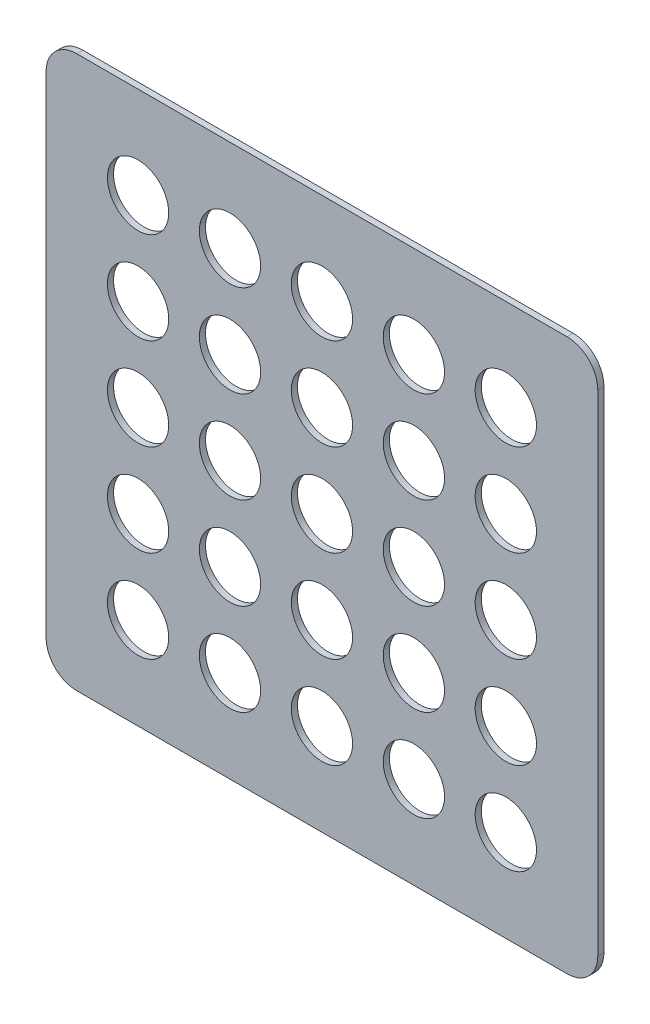
ISO-10303-21;
HEADER;
FILE_DESCRIPTION(('STEP AP214'),'2;1');
FILE_NAME('part.step','',(''),(''),'','','');
FILE_SCHEMA(('AUTOMOTIVE_DESIGN { 1 0 10303 214 1 1 1 1 }'));
ENDSEC;
DATA;
#1=APPLICATION_CONTEXT('core data for automotive mechanical design processes');
#2=APPLICATION_PROTOCOL_DEFINITION('international standard','automotive_design',2000,#1);
#3=PRODUCT_CONTEXT('',#1,'mechanical');
#4=PRODUCT('Part','Part','',(#3));
#5=PRODUCT_RELATED_PRODUCT_CATEGORY('part','',(#4));
#6=PRODUCT_DEFINITION_FORMATION('','',#4);
#7=PRODUCT_DEFINITION_CONTEXT('part definition',#1,'design');
#8=PRODUCT_DEFINITION('design','',#6,#7);
#9=PRODUCT_DEFINITION_SHAPE('','',#8);
#10=(LENGTH_UNIT() NAMED_UNIT(*) SI_UNIT(.MILLI.,.METRE.));
#11=(NAMED_UNIT(*) PLANE_ANGLE_UNIT() SI_UNIT($,.RADIAN.));
#12=(NAMED_UNIT(*) SI_UNIT($,.STERADIAN.) SOLID_ANGLE_UNIT());
#13=UNCERTAINTY_MEASURE_WITH_UNIT(LENGTH_MEASURE(1.E-05),#10,'distance_accuracy_value','');
#14=(GEOMETRIC_REPRESENTATION_CONTEXT(3) GLOBAL_UNCERTAINTY_ASSIGNED_CONTEXT((#13)) GLOBAL_UNIT_ASSIGNED_CONTEXT((#10,
#11,#12)) REPRESENTATION_CONTEXT('',''));
#15=CARTESIAN_POINT('',(0.,0.,0.));
#16=DIRECTION('',(0.,0.,1.));
#17=DIRECTION('',(1.,0.,0.));
#18=AXIS2_PLACEMENT_3D('',#15,#16,#17);
#19=CARTESIAN_POINT('',(2.25,-2.25,0.05));
#20=DIRECTION('',(-1.,0.,0.));
#21=DIRECTION('',(0.,0.,1.));
#22=AXIS2_PLACEMENT_3D('',#19,#20,#21);
#23=PLANE('',#22);
#24=DIRECTION('',(0.,1.,0.));
#25=VECTOR('',#24,1.);
#26=CARTESIAN_POINT('',(2.25,-2.25,0.05));
#27=LINE('',#26,#25);
#28=CARTESIAN_POINT('',(2.25,-2.,0.05));
#29=VERTEX_POINT('',#28);
#30=CARTESIAN_POINT('',(2.25,2.,0.05));
#31=VERTEX_POINT('',#30);
#32=EDGE_CURVE('E122',#29,#31,#27,.T.);
#33=ORIENTED_EDGE('',*,*,#32,.F.);
#34=DIRECTION('',(0.,0.,-1.));
#35=VECTOR('',#34,1.);
#36=CARTESIAN_POINT('',(2.25,-2.,0.05));
#37=LINE('',#36,#35);
#38=CARTESIAN_POINT('',(2.25,-2.,0.));
#39=VERTEX_POINT('',#38);
#40=EDGE_CURVE('E107',#29,#39,#37,.T.);
#41=ORIENTED_EDGE('',*,*,#40,.T.);
#42=DIRECTION('',(0.,1.,0.));
#43=VECTOR('',#42,1.);
#44=CARTESIAN_POINT('',(2.25,-2.25,0.));
#45=LINE('',#44,#43);
#46=CARTESIAN_POINT('',(2.25,2.,0.));
#47=VERTEX_POINT('',#46);
#48=EDGE_CURVE('E119',#39,#47,#45,.T.);
#49=ORIENTED_EDGE('',*,*,#48,.T.);
#50=DIRECTION('',(0.,0.,-1.));
#51=VECTOR('',#50,1.);
#52=CARTESIAN_POINT('',(2.25,2.,0.05));
#53=LINE('',#52,#51);
#54=EDGE_CURVE('E124',#47,#31,#53,.F.);
#55=ORIENTED_EDGE('',*,*,#54,.T.);
#56=EDGE_LOOP('',(#33,#41,#49,#55));
#57=FACE_BOUND('',#56,.T.);
#58=ADVANCED_FACE('F37',(#57),#23,.F.);
#59=CARTESIAN_POINT('',(-2.25,2.25,0.05));
#60=DIRECTION('',(0.,-1.,0.));
#61=DIRECTION('',(0.,0.,-1.));
#62=AXIS2_PLACEMENT_3D('',#59,#60,#61);
#63=PLANE('',#62);
#64=DIRECTION('',(-1.,0.,0.));
#65=VECTOR('',#64,1.);
#66=CARTESIAN_POINT('',(-2.25,2.25,0.));
#67=LINE('',#66,#65);
#68=CARTESIAN_POINT('',(2.,2.25,0.));
#69=VERTEX_POINT('',#68);
#70=CARTESIAN_POINT('',(-2.,2.25,0.));
#71=VERTEX_POINT('',#70);
#72=EDGE_CURVE('E128',#69,#71,#67,.T.);
#73=ORIENTED_EDGE('',*,*,#72,.T.);
#74=DIRECTION('',(0.,0.,-1.));
#75=VECTOR('',#74,1.);
#76=CARTESIAN_POINT('',(-2.,2.25,0.05));
#77=LINE('',#76,#75);
#78=CARTESIAN_POINT('',(-2.,2.25,0.05));
#79=VERTEX_POINT('',#78);
#80=EDGE_CURVE('E12',#71,#79,#77,.F.);
#81=ORIENTED_EDGE('',*,*,#80,.T.);
#82=DIRECTION('',(-1.,0.,0.));
#83=VECTOR('',#82,1.);
#84=CARTESIAN_POINT('',(-2.25,2.25,0.05));
#85=LINE('',#84,#83);
#86=CARTESIAN_POINT('',(2.,2.25,0.05));
#87=VERTEX_POINT('',#86);
#88=EDGE_CURVE('E168',#87,#79,#85,.T.);
#89=ORIENTED_EDGE('',*,*,#88,.F.);
#90=DIRECTION('',(0.,0.,-1.));
#91=VECTOR('',#90,1.);
#92=CARTESIAN_POINT('',(2.,2.25,0.05));
#93=LINE('',#92,#91);
#94=EDGE_CURVE('E45',#87,#69,#93,.T.);
#95=ORIENTED_EDGE('',*,*,#94,.T.);
#96=EDGE_LOOP('',(#73,#81,#89,#95));
#97=FACE_BOUND('',#96,.T.);
#98=ADVANCED_FACE('F166',(#97),#63,.F.);
#99=CARTESIAN_POINT('',(-2.25,-2.25,0.05));
#100=DIRECTION('',(1.,0.,0.));
#101=DIRECTION('',(0.,0.,-1.));
#102=AXIS2_PLACEMENT_3D('',#99,#100,#101);
#103=PLANE('',#102);
#104=DIRECTION('',(0.,-1.,0.));
#105=VECTOR('',#104,1.);
#106=CARTESIAN_POINT('',(-2.25,-2.25,0.));
#107=LINE('',#106,#105);
#108=CARTESIAN_POINT('',(-2.25,2.,0.));
#109=VERTEX_POINT('',#108);
#110=CARTESIAN_POINT('',(-2.25,-2.,0.));
#111=VERTEX_POINT('',#110);
#112=EDGE_CURVE('E132',#109,#111,#107,.T.);
#113=ORIENTED_EDGE('',*,*,#112,.T.);
#114=DIRECTION('',(0.,0.,-1.));
#115=VECTOR('',#114,1.);
#116=CARTESIAN_POINT('',(-2.25,-2.,0.05));
#117=LINE('',#116,#115);
#118=CARTESIAN_POINT('',(-2.25,-2.,0.05));
#119=VERTEX_POINT('',#118);
#120=EDGE_CURVE('E52',#111,#119,#117,.F.);
#121=ORIENTED_EDGE('',*,*,#120,.T.);
#122=DIRECTION('',(0.,-1.,0.));
#123=VECTOR('',#122,1.);
#124=CARTESIAN_POINT('',(-2.25,-2.25,0.05));
#125=LINE('',#124,#123);
#126=CARTESIAN_POINT('',(-2.25,2.,0.05));
#127=VERTEX_POINT('',#126);
#128=EDGE_CURVE('E176',#127,#119,#125,.T.);
#129=ORIENTED_EDGE('',*,*,#128,.F.);
#130=DIRECTION('',(0.,0.,-1.));
#131=VECTOR('',#130,1.);
#132=CARTESIAN_POINT('',(-2.25,2.,0.05));
#133=LINE('',#132,#131);
#134=EDGE_CURVE('E159',#127,#109,#133,.T.);
#135=ORIENTED_EDGE('',*,*,#134,.T.);
#136=EDGE_LOOP('',(#113,#121,#129,#135));
#137=FACE_BOUND('',#136,.T.);
#138=ADVANCED_FACE('F175',(#137),#103,.F.);
#139=CARTESIAN_POINT('',(-2.25,-2.25,0.05));
#140=DIRECTION('',(0.,1.,0.));
#141=DIRECTION('',(0.,0.,1.));
#142=AXIS2_PLACEMENT_3D('',#139,#140,#141);
#143=PLANE('',#142);
#144=DIRECTION('',(1.,0.,0.));
#145=VECTOR('',#144,1.);
#146=CARTESIAN_POINT('',(-2.25,-2.25,0.));
#147=LINE('',#146,#145);
#148=CARTESIAN_POINT('',(-2.,-2.25,0.));
#149=VERTEX_POINT('',#148);
#150=CARTESIAN_POINT('',(2.,-2.25,0.));
#151=VERTEX_POINT('',#150);
#152=EDGE_CURVE('E142',#149,#151,#147,.T.);
#153=ORIENTED_EDGE('',*,*,#152,.T.);
#154=DIRECTION('',(0.,0.,-1.));
#155=VECTOR('',#154,1.);
#156=CARTESIAN_POINT('',(2.,-2.25,0.05));
#157=LINE('',#156,#155);
#158=CARTESIAN_POINT('',(2.,-2.25,0.05));
#159=VERTEX_POINT('',#158);
#160=EDGE_CURVE('E108',#151,#159,#157,.F.);
#161=ORIENTED_EDGE('',*,*,#160,.T.);
#162=DIRECTION('',(1.,0.,0.));
#163=VECTOR('',#162,1.);
#164=CARTESIAN_POINT('',(-2.25,-2.25,0.05));
#165=LINE('',#164,#163);
#166=CARTESIAN_POINT('',(-2.,-2.25,0.05));
#167=VERTEX_POINT('',#166);
#168=EDGE_CURVE('E138',#167,#159,#165,.T.);
#169=ORIENTED_EDGE('',*,*,#168,.F.);
#170=DIRECTION('',(0.,0.,-1.));
#171=VECTOR('',#170,1.);
#172=CARTESIAN_POINT('',(-2.,-2.25,0.05));
#173=LINE('',#172,#171);
#174=EDGE_CURVE('E113',#167,#149,#173,.T.);
#175=ORIENTED_EDGE('',*,*,#174,.T.);
#176=EDGE_LOOP('',(#153,#161,#169,#175));
#177=FACE_BOUND('',#176,.T.);
#178=ADVANCED_FACE('F390',(#177),#143,.F.);
#179=CARTESIAN_POINT('',(0.,0.,0.05));
#180=DIRECTION('',(0.,0.,-1.));
#181=DIRECTION('',(-1.,0.,0.));
#182=AXIS2_PLACEMENT_3D('',#179,#180,#181);
#183=PLANE('',#182);
#184=CARTESIAN_POINT('',(1.49999999999999,-1.5,0.05));
#185=DIRECTION('',(0.,0.,1.));
#186=DIRECTION('',(1.,0.,0.));
#187=AXIS2_PLACEMENT_3D('',#184,#185,#186);
#188=CIRCLE('',#187,0.25);
#189=CARTESIAN_POINT('',(1.74999999999999,-1.5,0.05));
#190=VERTEX_POINT('',#189);
#191=EDGE_CURVE('E262',#190,#190,#188,.T.);
#192=ORIENTED_EDGE('',*,*,#191,.F.);
#193=EDGE_LOOP('',(#192));
#194=FACE_BOUND('',#193,.T.);
#195=CARTESIAN_POINT('',(1.5,-0.75,0.05));
#196=DIRECTION('',(0.,0.,1.));
#197=DIRECTION('',(1.,0.,0.));
#198=AXIS2_PLACEMENT_3D('',#195,#196,#197);
#199=CIRCLE('',#198,0.25);
#200=CARTESIAN_POINT('',(1.75,-0.75,0.05));
#201=VERTEX_POINT('',#200);
#202=EDGE_CURVE('E274',#201,#201,#199,.T.);
#203=ORIENTED_EDGE('',*,*,#202,.F.);
#204=EDGE_LOOP('',(#203));
#205=FACE_BOUND('',#204,.T.);
#206=CARTESIAN_POINT('',(1.5,0.,0.05));
#207=DIRECTION('',(0.,0.,1.));
#208=DIRECTION('',(1.,0.,0.));
#209=AXIS2_PLACEMENT_3D('',#206,#207,#208);
#210=CIRCLE('',#209,0.25);
#211=CARTESIAN_POINT('',(1.75,0.,0.05));
#212=VERTEX_POINT('',#211);
#213=EDGE_CURVE('E280',#212,#212,#210,.T.);
#214=ORIENTED_EDGE('',*,*,#213,.F.);
#215=EDGE_LOOP('',(#214));
#216=FACE_BOUND('',#215,.T.);
#217=CARTESIAN_POINT('',(0.75,0.,0.05));
#218=DIRECTION('',(0.,0.,1.));
#219=DIRECTION('',(1.,0.,0.));
#220=AXIS2_PLACEMENT_3D('',#217,#218,#219);
#221=CIRCLE('',#220,0.25);
#222=CARTESIAN_POINT('',(1.,0.,0.05));
#223=VERTEX_POINT('',#222);
#224=EDGE_CURVE('E287',#223,#223,#221,.T.);
#225=ORIENTED_EDGE('',*,*,#224,.F.);
#226=EDGE_LOOP('',(#225));
#227=FACE_BOUND('',#226,.T.);
#228=CARTESIAN_POINT('',(0.,0.,0.05));
#229=DIRECTION('',(0.,0.,1.));
#230=DIRECTION('',(1.,0.,0.));
#231=AXIS2_PLACEMENT_3D('',#228,#229,#230);
#232=CIRCLE('',#231,0.25);
#233=CARTESIAN_POINT('',(0.25,0.,0.05));
#234=VERTEX_POINT('',#233);
#235=EDGE_CURVE('E296',#234,#234,#232,.T.);
#236=ORIENTED_EDGE('',*,*,#235,.F.);
#237=EDGE_LOOP('',(#236));
#238=FACE_BOUND('',#237,.T.);
#239=CARTESIAN_POINT('',(-0.75,0.,0.05));
#240=DIRECTION('',(0.,0.,1.));
#241=DIRECTION('',(1.,0.,0.));
#242=AXIS2_PLACEMENT_3D('',#239,#240,#241);
#243=CIRCLE('',#242,0.25);
#244=CARTESIAN_POINT('',(-0.5,0.,0.05));
#245=VERTEX_POINT('',#244);
#246=EDGE_CURVE('E302',#245,#245,#243,.T.);
#247=ORIENTED_EDGE('',*,*,#246,.F.);
#248=EDGE_LOOP('',(#247));
#249=FACE_BOUND('',#248,.T.);
#250=CARTESIAN_POINT('',(-0.749999999999992,0.750000000000005,0.05));
#251=DIRECTION('',(0.,0.,1.));
#252=DIRECTION('',(1.,0.,0.));
#253=AXIS2_PLACEMENT_3D('',#250,#251,#252);
#254=CIRCLE('',#253,0.25);
#255=CARTESIAN_POINT('',(-0.499999999999992,0.750000000000005,0.05));
#256=VERTEX_POINT('',#255);
#257=EDGE_CURVE('E309',#256,#256,#254,.T.);
#258=ORIENTED_EDGE('',*,*,#257,.F.);
#259=EDGE_LOOP('',(#258));
#260=FACE_BOUND('',#259,.T.);
#261=CARTESIAN_POINT('',(0.,0.75,0.05));
#262=DIRECTION('',(0.,0.,1.));
#263=DIRECTION('',(1.,0.,0.));
#264=AXIS2_PLACEMENT_3D('',#261,#262,#263);
#265=CIRCLE('',#264,0.25);
#266=CARTESIAN_POINT('',(0.249999999999997,0.75,0.05));
#267=VERTEX_POINT('',#266);
#268=EDGE_CURVE('E315',#267,#267,#265,.T.);
#269=ORIENTED_EDGE('',*,*,#268,.F.);
#270=EDGE_LOOP('',(#269));
#271=FACE_BOUND('',#270,.T.);
#272=CARTESIAN_POINT('',(0.749999999999997,0.75,0.05));
#273=DIRECTION('',(0.,0.,1.));
#274=DIRECTION('',(1.,0.,0.));
#275=AXIS2_PLACEMENT_3D('',#272,#273,#274);
#276=CIRCLE('',#275,0.25);
#277=CARTESIAN_POINT('',(0.999999999999997,0.75,0.05));
#278=VERTEX_POINT('',#277);
#279=EDGE_CURVE('E195',#278,#278,#276,.T.);
#280=ORIENTED_EDGE('',*,*,#279,.F.);
#281=EDGE_LOOP('',(#280));
#282=FACE_BOUND('',#281,.T.);
#283=CARTESIAN_POINT('',(1.5,0.75,0.05));
#284=DIRECTION('',(0.,0.,1.));
#285=DIRECTION('',(1.,0.,0.));
#286=AXIS2_PLACEMENT_3D('',#283,#284,#285);
#287=CIRCLE('',#286,0.25);
#288=CARTESIAN_POINT('',(1.75,0.75,0.05));
#289=VERTEX_POINT('',#288);
#290=EDGE_CURVE('E210',#289,#289,#287,.T.);
#291=ORIENTED_EDGE('',*,*,#290,.F.);
#292=EDGE_LOOP('',(#291));
#293=FACE_BOUND('',#292,.T.);
#294=CARTESIAN_POINT('',(1.49999999999999,1.5,0.05));
#295=DIRECTION('',(0.,0.,1.));
#296=DIRECTION('',(1.,0.,0.));
#297=AXIS2_PLACEMENT_3D('',#294,#295,#296);
#298=CIRCLE('',#297,0.25);
#299=CARTESIAN_POINT('',(1.74999999999999,1.5,0.05));
#300=VERTEX_POINT('',#299);
#301=EDGE_CURVE('E216',#300,#300,#298,.T.);
#302=ORIENTED_EDGE('',*,*,#301,.F.);
#303=EDGE_LOOP('',(#302));
#304=FACE_BOUND('',#303,.T.);
#305=CARTESIAN_POINT('',(0.749999999999995,1.5,0.05));
#306=DIRECTION('',(0.,0.,1.));
#307=DIRECTION('',(1.,0.,0.));
#308=AXIS2_PLACEMENT_3D('',#305,#306,#307);
#309=CIRCLE('',#308,0.25);
#310=CARTESIAN_POINT('',(0.999999999999995,1.5,0.05));
#311=VERTEX_POINT('',#310);
#312=EDGE_CURVE('E223',#311,#311,#309,.T.);
#313=ORIENTED_EDGE('',*,*,#312,.F.);
#314=EDGE_LOOP('',(#313));
#315=FACE_BOUND('',#314,.T.);
#316=CARTESIAN_POINT('',(0.,1.5,0.05));
#317=DIRECTION('',(0.,0.,1.));
#318=DIRECTION('',(1.,0.,0.));
#319=AXIS2_PLACEMENT_3D('',#316,#317,#318);
#320=CIRCLE('',#319,0.25);
#321=CARTESIAN_POINT('',(0.249999999999995,1.5,0.05));
#322=VERTEX_POINT('',#321);
#323=EDGE_CURVE('E233',#322,#322,#320,.T.);
#324=ORIENTED_EDGE('',*,*,#323,.F.);
#325=EDGE_LOOP('',(#324));
#326=FACE_BOUND('',#325,.T.);
#327=CARTESIAN_POINT('',(-0.749999999999984,1.50000000000001,0.05));
#328=DIRECTION('',(0.,0.,1.));
#329=DIRECTION('',(1.,0.,0.));
#330=AXIS2_PLACEMENT_3D('',#327,#328,#329);
#331=CIRCLE('',#330,0.25);
#332=CARTESIAN_POINT('',(-0.499999999999984,1.50000000000001,0.05));
#333=VERTEX_POINT('',#332);
#334=EDGE_CURVE('E239',#333,#333,#331,.T.);
#335=ORIENTED_EDGE('',*,*,#334,.F.);
#336=EDGE_LOOP('',(#335));
#337=FACE_BOUND('',#336,.T.);
#338=CARTESIAN_POINT('',(-1.49999999999998,1.50000000000001,0.05));
#339=DIRECTION('',(0.,0.,1.));
#340=DIRECTION('',(1.,0.,0.));
#341=AXIS2_PLACEMENT_3D('',#338,#339,#340);
#342=CIRCLE('',#341,0.25);
#343=CARTESIAN_POINT('',(-1.24999999999998,1.50000000000001,0.05));
#344=VERTEX_POINT('',#343);
#345=EDGE_CURVE('E246',#344,#344,#342,.T.);
#346=ORIENTED_EDGE('',*,*,#345,.F.);
#347=EDGE_LOOP('',(#346));
#348=FACE_BOUND('',#347,.T.);
#349=CARTESIAN_POINT('',(-1.49999999999999,0.750000000000011,0.05));
#350=DIRECTION('',(0.,0.,1.));
#351=DIRECTION('',(1.,0.,0.));
#352=AXIS2_PLACEMENT_3D('',#349,#350,#351);
#353=CIRCLE('',#352,0.25);
#354=CARTESIAN_POINT('',(-1.24999999999999,0.750000000000011,0.05));
#355=VERTEX_POINT('',#354);
#356=EDGE_CURVE('E256',#355,#355,#353,.T.);
#357=ORIENTED_EDGE('',*,*,#356,.F.);
#358=EDGE_LOOP('',(#357));
#359=FACE_BOUND('',#358,.T.);
#360=CARTESIAN_POINT('',(0.749999999999995,-1.5,0.05));
#361=DIRECTION('',(0.,0.,1.));
#362=DIRECTION('',(1.,0.,0.));
#363=AXIS2_PLACEMENT_3D('',#360,#361,#362);
#364=CIRCLE('',#363,0.25);
#365=CARTESIAN_POINT('',(0.999999999999995,-1.5,0.05));
#366=VERTEX_POINT('',#365);
#367=EDGE_CURVE('E370',#366,#366,#364,.T.);
#368=ORIENTED_EDGE('',*,*,#367,.F.);
#369=EDGE_LOOP('',(#368));
#370=FACE_BOUND('',#369,.T.);
#371=CARTESIAN_POINT('',(0.749999999999998,-0.75,0.05));
#372=DIRECTION('',(0.,0.,1.));
#373=DIRECTION('',(1.,0.,0.));
#374=AXIS2_PLACEMENT_3D('',#371,#372,#373);
#375=CIRCLE('',#374,0.25);
#376=CARTESIAN_POINT('',(0.999999999999997,-0.75,0.05));
#377=VERTEX_POINT('',#376);
#378=EDGE_CURVE('E364',#377,#377,#375,.T.);
#379=ORIENTED_EDGE('',*,*,#378,.F.);
#380=EDGE_LOOP('',(#379));
#381=FACE_BOUND('',#380,.T.);
#382=CARTESIAN_POINT('',(0.,-1.5,0.05));
#383=DIRECTION('',(0.,0.,1.));
#384=DIRECTION('',(1.,0.,0.));
#385=AXIS2_PLACEMENT_3D('',#382,#383,#384);
#386=CIRCLE('',#385,0.25);
#387=CARTESIAN_POINT('',(0.249999999999995,-1.5,0.05));
#388=VERTEX_POINT('',#387);
#389=EDGE_CURVE('E358',#388,#388,#386,.T.);
#390=ORIENTED_EDGE('',*,*,#389,.F.);
#391=EDGE_LOOP('',(#390));
#392=FACE_BOUND('',#391,.T.);
#393=CARTESIAN_POINT('',(0.,-0.75,0.05));
#394=DIRECTION('',(0.,0.,1.));
#395=DIRECTION('',(1.,0.,0.));
#396=AXIS2_PLACEMENT_3D('',#393,#394,#395);
#397=CIRCLE('',#396,0.25);
#398=CARTESIAN_POINT('',(0.249999999999997,-0.75,0.05));
#399=VERTEX_POINT('',#398);
#400=EDGE_CURVE('E350',#399,#399,#397,.T.);
#401=ORIENTED_EDGE('',*,*,#400,.F.);
#402=EDGE_LOOP('',(#401));
#403=FACE_BOUND('',#402,.T.);
#404=CARTESIAN_POINT('',(-0.750000000000003,-0.749999999999995,0.05));
#405=DIRECTION('',(0.,0.,1.));
#406=DIRECTION('',(1.,0.,0.));
#407=AXIS2_PLACEMENT_3D('',#404,#405,#406);
#408=CIRCLE('',#407,0.25);
#409=CARTESIAN_POINT('',(-0.500000000000003,-0.749999999999995,0.05));
#410=VERTEX_POINT('',#409);
#411=EDGE_CURVE('E343',#410,#410,#408,.T.);
#412=ORIENTED_EDGE('',*,*,#411,.F.);
#413=EDGE_LOOP('',(#412));
#414=FACE_BOUND('',#413,.T.);
#415=CARTESIAN_POINT('',(-0.750000000000005,-1.49999999999999,0.05));
#416=DIRECTION('',(0.,0.,1.));
#417=DIRECTION('',(1.,0.,0.));
#418=AXIS2_PLACEMENT_3D('',#415,#416,#417);
#419=CIRCLE('',#418,0.25);
#420=CARTESIAN_POINT('',(-0.500000000000005,-1.49999999999999,0.05));
#421=VERTEX_POINT('',#420);
#422=EDGE_CURVE('E337',#421,#421,#419,.T.);
#423=ORIENTED_EDGE('',*,*,#422,.F.);
#424=EDGE_LOOP('',(#423));
#425=FACE_BOUND('',#424,.T.);
#426=CARTESIAN_POINT('',(-1.50000000000001,-1.49999999999999,0.05));
#427=DIRECTION('',(0.,0.,1.));
#428=DIRECTION('',(1.,0.,0.));
#429=AXIS2_PLACEMENT_3D('',#426,#427,#428);
#430=CIRCLE('',#429,0.25);
#431=CARTESIAN_POINT('',(-1.25000000000001,-1.49999999999999,0.05));
#432=VERTEX_POINT('',#431);
#433=EDGE_CURVE('E327',#432,#432,#430,.T.);
#434=ORIENTED_EDGE('',*,*,#433,.F.);
#435=EDGE_LOOP('',(#434));
#436=FACE_BOUND('',#435,.T.);
#437=CARTESIAN_POINT('',(-1.5,-0.749999999999989,0.05));
#438=DIRECTION('',(0.,0.,1.));
#439=DIRECTION('',(1.,0.,0.));
#440=AXIS2_PLACEMENT_3D('',#437,#438,#439);
#441=CIRCLE('',#440,0.25);
#442=CARTESIAN_POINT('',(-1.25,-0.749999999999989,0.05));
#443=VERTEX_POINT('',#442);
#444=EDGE_CURVE('E320',#443,#443,#441,.T.);
#445=ORIENTED_EDGE('',*,*,#444,.F.);
#446=EDGE_LOOP('',(#445));
#447=FACE_BOUND('',#446,.T.);
#448=CARTESIAN_POINT('',(-1.5,0.,0.05));
#449=DIRECTION('',(0.,0.,1.));
#450=DIRECTION('',(1.,0.,0.));
#451=AXIS2_PLACEMENT_3D('',#448,#449,#450);
#452=CIRCLE('',#451,0.25);
#453=CARTESIAN_POINT('',(-1.25,0.,0.05));
#454=VERTEX_POINT('',#453);
#455=EDGE_CURVE('E135',#454,#454,#452,.T.);
#456=ORIENTED_EDGE('',*,*,#455,.F.);
#457=EDGE_LOOP('',(#456));
#458=FACE_BOUND('',#457,.T.);
#459=ORIENTED_EDGE('',*,*,#168,.T.);
#460=CARTESIAN_POINT('',(2.,-2.,0.05));
#461=DIRECTION('',(0.,0.,-1.));
#462=DIRECTION('',(-1.,0.,0.));
#463=AXIS2_PLACEMENT_3D('',#460,#461,#462);
#464=CIRCLE('',#463,0.25);
#465=EDGE_CURVE('E157',#159,#29,#464,.F.);
#466=ORIENTED_EDGE('',*,*,#465,.T.);
#467=ORIENTED_EDGE('',*,*,#32,.T.);
#468=CARTESIAN_POINT('',(2.,2.,0.05));
#469=DIRECTION('',(0.,0.,-1.));
#470=DIRECTION('',(-1.,0.,0.));
#471=AXIS2_PLACEMENT_3D('',#468,#469,#470);
#472=CIRCLE('',#471,0.25);
#473=EDGE_CURVE('E152',#31,#87,#472,.F.);
#474=ORIENTED_EDGE('',*,*,#473,.T.);
#475=ORIENTED_EDGE('',*,*,#88,.T.);
#476=CARTESIAN_POINT('',(-2.,2.,0.05));
#477=DIRECTION('',(0.,0.,-1.));
#478=DIRECTION('',(-1.,0.,0.));
#479=AXIS2_PLACEMENT_3D('',#476,#477,#478);
#480=CIRCLE('',#479,0.25);
#481=EDGE_CURVE('E59',#79,#127,#480,.F.);
#482=ORIENTED_EDGE('',*,*,#481,.T.);
#483=ORIENTED_EDGE('',*,*,#128,.T.);
#484=CARTESIAN_POINT('',(-2.,-2.,0.05));
#485=DIRECTION('',(0.,0.,-1.));
#486=DIRECTION('',(-1.,0.,0.));
#487=AXIS2_PLACEMENT_3D('',#484,#485,#486);
#488=CIRCLE('',#487,0.25);
#489=EDGE_CURVE('E155',#119,#167,#488,.F.);
#490=ORIENTED_EDGE('',*,*,#489,.T.);
#491=EDGE_LOOP('',(#459,#466,#467,#474,#475,#482,#483,#490));
#492=FACE_BOUND('',#491,.T.);
#493=ADVANCED_FACE('F387',(#194,#205,#216,#227,#238,#249,#260,#271,#282,#293,#304,#315,#326,
#337,#348,#359,#370,#381,#392,#403,#414,#425,#436,#447,#458,#492),#183,.F.);
#494=CARTESIAN_POINT('',(0.,0.,0.));
#495=DIRECTION('',(0.,0.,-1.));
#496=DIRECTION('',(-1.,0.,0.));
#497=AXIS2_PLACEMENT_3D('',#494,#495,#496);
#498=PLANE('',#497);
#499=CARTESIAN_POINT('',(1.49999999999999,-1.5,0.));
#500=DIRECTION('',(0.,0.,1.));
#501=DIRECTION('',(1.,0.,0.));
#502=AXIS2_PLACEMENT_3D('',#499,#500,#501);
#503=CIRCLE('',#502,0.25);
#504=CARTESIAN_POINT('',(1.74999999999999,-1.5,0.));
#505=VERTEX_POINT('',#504);
#506=EDGE_CURVE('E266',#505,#505,#503,.T.);
#507=ORIENTED_EDGE('',*,*,#506,.T.);
#508=EDGE_LOOP('',(#507));
#509=FACE_BOUND('',#508,.T.);
#510=CARTESIAN_POINT('',(1.5,-0.75,0.));
#511=DIRECTION('',(0.,0.,1.));
#512=DIRECTION('',(1.,0.,0.));
#513=AXIS2_PLACEMENT_3D('',#510,#511,#512);
#514=CIRCLE('',#513,0.25);
#515=CARTESIAN_POINT('',(1.75,-0.75,0.));
#516=VERTEX_POINT('',#515);
#517=EDGE_CURVE('E278',#516,#516,#514,.T.);
#518=ORIENTED_EDGE('',*,*,#517,.T.);
#519=EDGE_LOOP('',(#518));
#520=FACE_BOUND('',#519,.T.);
#521=CARTESIAN_POINT('',(1.5,0.,0.));
#522=DIRECTION('',(0.,0.,1.));
#523=DIRECTION('',(1.,0.,0.));
#524=AXIS2_PLACEMENT_3D('',#521,#522,#523);
#525=CIRCLE('',#524,0.25);
#526=CARTESIAN_POINT('',(1.75,0.,0.));
#527=VERTEX_POINT('',#526);
#528=EDGE_CURVE('E284',#527,#527,#525,.T.);
#529=ORIENTED_EDGE('',*,*,#528,.T.);
#530=EDGE_LOOP('',(#529));
#531=FACE_BOUND('',#530,.T.);
#532=CARTESIAN_POINT('',(0.75,0.,0.));
#533=DIRECTION('',(0.,0.,1.));
#534=DIRECTION('',(1.,0.,0.));
#535=AXIS2_PLACEMENT_3D('',#532,#533,#534);
#536=CIRCLE('',#535,0.25);
#537=CARTESIAN_POINT('',(1.,0.,0.));
#538=VERTEX_POINT('',#537);
#539=EDGE_CURVE('E291',#538,#538,#536,.T.);
#540=ORIENTED_EDGE('',*,*,#539,.T.);
#541=EDGE_LOOP('',(#540));
#542=FACE_BOUND('',#541,.T.);
#543=CARTESIAN_POINT('',(0.,0.,0.));
#544=DIRECTION('',(0.,0.,1.));
#545=DIRECTION('',(1.,0.,0.));
#546=AXIS2_PLACEMENT_3D('',#543,#544,#545);
#547=CIRCLE('',#546,0.25);
#548=CARTESIAN_POINT('',(0.25,0.,0.));
#549=VERTEX_POINT('',#548);
#550=EDGE_CURVE('E300',#549,#549,#547,.T.);
#551=ORIENTED_EDGE('',*,*,#550,.T.);
#552=EDGE_LOOP('',(#551));
#553=FACE_BOUND('',#552,.T.);
#554=CARTESIAN_POINT('',(-0.75,0.,0.));
#555=DIRECTION('',(0.,0.,1.));
#556=DIRECTION('',(1.,0.,0.));
#557=AXIS2_PLACEMENT_3D('',#554,#555,#556);
#558=CIRCLE('',#557,0.25);
#559=CARTESIAN_POINT('',(-0.5,0.,0.));
#560=VERTEX_POINT('',#559);
#561=EDGE_CURVE('E306',#560,#560,#558,.T.);
#562=ORIENTED_EDGE('',*,*,#561,.T.);
#563=EDGE_LOOP('',(#562));
#564=FACE_BOUND('',#563,.T.);
#565=CARTESIAN_POINT('',(-0.749999999999992,0.750000000000005,0.));
#566=DIRECTION('',(0.,0.,1.));
#567=DIRECTION('',(1.,0.,0.));
#568=AXIS2_PLACEMENT_3D('',#565,#566,#567);
#569=CIRCLE('',#568,0.25);
#570=CARTESIAN_POINT('',(-0.499999999999992,0.750000000000005,0.));
#571=VERTEX_POINT('',#570);
#572=EDGE_CURVE('E313',#571,#571,#569,.T.);
#573=ORIENTED_EDGE('',*,*,#572,.T.);
#574=EDGE_LOOP('',(#573));
#575=FACE_BOUND('',#574,.T.);
#576=CARTESIAN_POINT('',(0.,0.75,0.));
#577=DIRECTION('',(0.,0.,1.));
#578=DIRECTION('',(1.,0.,0.));
#579=AXIS2_PLACEMENT_3D('',#576,#577,#578);
#580=CIRCLE('',#579,0.25);
#581=CARTESIAN_POINT('',(0.249999999999997,0.75,0.));
#582=VERTEX_POINT('',#581);
#583=EDGE_CURVE('E200',#582,#582,#580,.T.);
#584=ORIENTED_EDGE('',*,*,#583,.T.);
#585=EDGE_LOOP('',(#584));
#586=FACE_BOUND('',#585,.T.);
#587=CARTESIAN_POINT('',(0.749999999999997,0.75,0.));
#588=DIRECTION('',(0.,0.,1.));
#589=DIRECTION('',(1.,0.,0.));
#590=AXIS2_PLACEMENT_3D('',#587,#588,#589);
#591=CIRCLE('',#590,0.25);
#592=CARTESIAN_POINT('',(0.999999999999997,0.75,0.));
#593=VERTEX_POINT('',#592);
#594=EDGE_CURVE('E199',#593,#593,#591,.T.);
#595=ORIENTED_EDGE('',*,*,#594,.T.);
#596=EDGE_LOOP('',(#595));
#597=FACE_BOUND('',#596,.T.);
#598=CARTESIAN_POINT('',(1.5,0.75,0.));
#599=DIRECTION('',(0.,0.,1.));
#600=DIRECTION('',(1.,0.,0.));
#601=AXIS2_PLACEMENT_3D('',#598,#599,#600);
#602=CIRCLE('',#601,0.25);
#603=CARTESIAN_POINT('',(1.75,0.75,0.));
#604=VERTEX_POINT('',#603);
#605=EDGE_CURVE('E214',#604,#604,#602,.T.);
#606=ORIENTED_EDGE('',*,*,#605,.T.);
#607=EDGE_LOOP('',(#606));
#608=FACE_BOUND('',#607,.T.);
#609=CARTESIAN_POINT('',(1.49999999999999,1.5,0.));
#610=DIRECTION('',(0.,0.,1.));
#611=DIRECTION('',(1.,0.,0.));
#612=AXIS2_PLACEMENT_3D('',#609,#610,#611);
#613=CIRCLE('',#612,0.25);
#614=CARTESIAN_POINT('',(1.74999999999999,1.5,0.));
#615=VERTEX_POINT('',#614);
#616=EDGE_CURVE('E220',#615,#615,#613,.T.);
#617=ORIENTED_EDGE('',*,*,#616,.T.);
#618=EDGE_LOOP('',(#617));
#619=FACE_BOUND('',#618,.T.);
#620=CARTESIAN_POINT('',(0.749999999999995,1.5,0.));
#621=DIRECTION('',(0.,0.,1.));
#622=DIRECTION('',(1.,0.,0.));
#623=AXIS2_PLACEMENT_3D('',#620,#621,#622);
#624=CIRCLE('',#623,0.25);
#625=CARTESIAN_POINT('',(0.999999999999995,1.5,0.));
#626=VERTEX_POINT('',#625);
#627=EDGE_CURVE('E227',#626,#626,#624,.T.);
#628=ORIENTED_EDGE('',*,*,#627,.T.);
#629=EDGE_LOOP('',(#628));
#630=FACE_BOUND('',#629,.T.);
#631=CARTESIAN_POINT('',(0.,1.5,0.));
#632=DIRECTION('',(0.,0.,1.));
#633=DIRECTION('',(1.,0.,0.));
#634=AXIS2_PLACEMENT_3D('',#631,#632,#633);
#635=CIRCLE('',#634,0.25);
#636=CARTESIAN_POINT('',(0.249999999999995,1.5,0.));
#637=VERTEX_POINT('',#636);
#638=EDGE_CURVE('E237',#637,#637,#635,.T.);
#639=ORIENTED_EDGE('',*,*,#638,.T.);
#640=EDGE_LOOP('',(#639));
#641=FACE_BOUND('',#640,.T.);
#642=CARTESIAN_POINT('',(-0.749999999999984,1.50000000000001,0.));
#643=DIRECTION('',(0.,0.,1.));
#644=DIRECTION('',(1.,0.,0.));
#645=AXIS2_PLACEMENT_3D('',#642,#643,#644);
#646=CIRCLE('',#645,0.25);
#647=CARTESIAN_POINT('',(-0.499999999999984,1.50000000000001,0.));
#648=VERTEX_POINT('',#647);
#649=EDGE_CURVE('E243',#648,#648,#646,.T.);
#650=ORIENTED_EDGE('',*,*,#649,.T.);
#651=EDGE_LOOP('',(#650));
#652=FACE_BOUND('',#651,.T.);
#653=CARTESIAN_POINT('',(-1.49999999999998,1.50000000000001,0.));
#654=DIRECTION('',(0.,0.,1.));
#655=DIRECTION('',(1.,0.,0.));
#656=AXIS2_PLACEMENT_3D('',#653,#654,#655);
#657=CIRCLE('',#656,0.25);
#658=CARTESIAN_POINT('',(-1.24999999999998,1.50000000000001,0.));
#659=VERTEX_POINT('',#658);
#660=EDGE_CURVE('E250',#659,#659,#657,.T.);
#661=ORIENTED_EDGE('',*,*,#660,.T.);
#662=EDGE_LOOP('',(#661));
#663=FACE_BOUND('',#662,.T.);
#664=CARTESIAN_POINT('',(-1.49999999999999,0.750000000000011,0.));
#665=DIRECTION('',(0.,0.,1.));
#666=DIRECTION('',(1.,0.,0.));
#667=AXIS2_PLACEMENT_3D('',#664,#665,#666);
#668=CIRCLE('',#667,0.25);
#669=CARTESIAN_POINT('',(-1.24999999999999,0.750000000000011,0.));
#670=VERTEX_POINT('',#669);
#671=EDGE_CURVE('E193',#670,#670,#668,.T.);
#672=ORIENTED_EDGE('',*,*,#671,.T.);
#673=EDGE_LOOP('',(#672));
#674=FACE_BOUND('',#673,.T.);
#675=CARTESIAN_POINT('',(0.749999999999995,-1.5,0.));
#676=DIRECTION('',(0.,0.,1.));
#677=DIRECTION('',(1.,0.,0.));
#678=AXIS2_PLACEMENT_3D('',#675,#676,#677);
#679=CIRCLE('',#678,0.25);
#680=CARTESIAN_POINT('',(0.999999999999995,-1.5,0.));
#681=VERTEX_POINT('',#680);
#682=EDGE_CURVE('E267',#681,#681,#679,.T.);
#683=ORIENTED_EDGE('',*,*,#682,.T.);
#684=EDGE_LOOP('',(#683));
#685=FACE_BOUND('',#684,.T.);
#686=CARTESIAN_POINT('',(0.749999999999998,-0.75,0.));
#687=DIRECTION('',(0.,0.,1.));
#688=DIRECTION('',(1.,0.,0.));
#689=AXIS2_PLACEMENT_3D('',#686,#687,#688);
#690=CIRCLE('',#689,0.25);
#691=CARTESIAN_POINT('',(0.999999999999997,-0.75,0.));
#692=VERTEX_POINT('',#691);
#693=EDGE_CURVE('E368',#692,#692,#690,.T.);
#694=ORIENTED_EDGE('',*,*,#693,.T.);
#695=EDGE_LOOP('',(#694));
#696=FACE_BOUND('',#695,.T.);
#697=CARTESIAN_POINT('',(0.,-1.5,0.));
#698=DIRECTION('',(0.,0.,1.));
#699=DIRECTION('',(1.,0.,0.));
#700=AXIS2_PLACEMENT_3D('',#697,#698,#699);
#701=CIRCLE('',#700,0.25);
#702=CARTESIAN_POINT('',(0.249999999999995,-1.5,0.));
#703=VERTEX_POINT('',#702);
#704=EDGE_CURVE('E362',#703,#703,#701,.T.);
#705=ORIENTED_EDGE('',*,*,#704,.T.);
#706=EDGE_LOOP('',(#705));
#707=FACE_BOUND('',#706,.T.);
#708=CARTESIAN_POINT('',(0.,-0.75,0.));
#709=DIRECTION('',(0.,0.,1.));
#710=DIRECTION('',(1.,0.,0.));
#711=AXIS2_PLACEMENT_3D('',#708,#709,#710);
#712=CIRCLE('',#711,0.25);
#713=CARTESIAN_POINT('',(0.249999999999997,-0.75,0.));
#714=VERTEX_POINT('',#713);
#715=EDGE_CURVE('E354',#714,#714,#712,.T.);
#716=ORIENTED_EDGE('',*,*,#715,.T.);
#717=EDGE_LOOP('',(#716));
#718=FACE_BOUND('',#717,.T.);
#719=CARTESIAN_POINT('',(-0.750000000000003,-0.749999999999995,0.));
#720=DIRECTION('',(0.,0.,1.));
#721=DIRECTION('',(1.,0.,0.));
#722=AXIS2_PLACEMENT_3D('',#719,#720,#721);
#723=CIRCLE('',#722,0.25);
#724=CARTESIAN_POINT('',(-0.500000000000003,-0.749999999999995,0.));
#725=VERTEX_POINT('',#724);
#726=EDGE_CURVE('E347',#725,#725,#723,.T.);
#727=ORIENTED_EDGE('',*,*,#726,.T.);
#728=EDGE_LOOP('',(#727));
#729=FACE_BOUND('',#728,.T.);
#730=CARTESIAN_POINT('',(-0.750000000000005,-1.49999999999999,0.));
#731=DIRECTION('',(0.,0.,1.));
#732=DIRECTION('',(1.,0.,0.));
#733=AXIS2_PLACEMENT_3D('',#730,#731,#732);
#734=CIRCLE('',#733,0.25);
#735=CARTESIAN_POINT('',(-0.500000000000005,-1.49999999999999,0.));
#736=VERTEX_POINT('',#735);
#737=EDGE_CURVE('E341',#736,#736,#734,.T.);
#738=ORIENTED_EDGE('',*,*,#737,.T.);
#739=EDGE_LOOP('',(#738));
#740=FACE_BOUND('',#739,.T.);
#741=CARTESIAN_POINT('',(-1.50000000000001,-1.49999999999999,0.));
#742=DIRECTION('',(0.,0.,1.));
#743=DIRECTION('',(1.,0.,0.));
#744=AXIS2_PLACEMENT_3D('',#741,#742,#743);
#745=CIRCLE('',#744,0.25);
#746=CARTESIAN_POINT('',(-1.25000000000001,-1.49999999999999,0.));
#747=VERTEX_POINT('',#746);
#748=EDGE_CURVE('E331',#747,#747,#745,.T.);
#749=ORIENTED_EDGE('',*,*,#748,.T.);
#750=EDGE_LOOP('',(#749));
#751=FACE_BOUND('',#750,.T.);
#752=CARTESIAN_POINT('',(-1.5,-0.749999999999989,0.));
#753=DIRECTION('',(0.,0.,1.));
#754=DIRECTION('',(1.,0.,0.));
#755=AXIS2_PLACEMENT_3D('',#752,#753,#754);
#756=CIRCLE('',#755,0.25);
#757=CARTESIAN_POINT('',(-1.25,-0.749999999999989,0.));
#758=VERTEX_POINT('',#757);
#759=EDGE_CURVE('E324',#758,#758,#756,.T.);
#760=ORIENTED_EDGE('',*,*,#759,.T.);
#761=EDGE_LOOP('',(#760));
#762=FACE_BOUND('',#761,.T.);
#763=CARTESIAN_POINT('',(-1.5,0.,0.));
#764=DIRECTION('',(0.,0.,1.));
#765=DIRECTION('',(1.,0.,0.));
#766=AXIS2_PLACEMENT_3D('',#763,#764,#765);
#767=CIRCLE('',#766,0.25);
#768=CARTESIAN_POINT('',(-1.25,0.,0.));
#769=VERTEX_POINT('',#768);
#770=EDGE_CURVE('E129',#769,#769,#767,.T.);
#771=ORIENTED_EDGE('',*,*,#770,.T.);
#772=EDGE_LOOP('',(#771));
#773=FACE_BOUND('',#772,.T.);
#774=ORIENTED_EDGE('',*,*,#48,.F.);
#775=CARTESIAN_POINT('',(2.,-2.,0.));
#776=DIRECTION('',(0.,0.,-1.));
#777=DIRECTION('',(-1.,0.,0.));
#778=AXIS2_PLACEMENT_3D('',#775,#776,#777);
#779=CIRCLE('',#778,0.25);
#780=EDGE_CURVE('E103',#39,#151,#779,.T.);
#781=ORIENTED_EDGE('',*,*,#780,.T.);
#782=ORIENTED_EDGE('',*,*,#152,.F.);
#783=CARTESIAN_POINT('',(-2.,-2.,0.));
#784=DIRECTION('',(0.,0.,-1.));
#785=DIRECTION('',(-1.,0.,0.));
#786=AXIS2_PLACEMENT_3D('',#783,#784,#785);
#787=CIRCLE('',#786,0.25);
#788=EDGE_CURVE('E114',#149,#111,#787,.T.);
#789=ORIENTED_EDGE('',*,*,#788,.T.);
#790=ORIENTED_EDGE('',*,*,#112,.F.);
#791=CARTESIAN_POINT('',(-2.,2.,0.));
#792=DIRECTION('',(0.,0.,-1.));
#793=DIRECTION('',(-1.,0.,0.));
#794=AXIS2_PLACEMENT_3D('',#791,#792,#793);
#795=CIRCLE('',#794,0.25);
#796=EDGE_CURVE('E146',#109,#71,#795,.T.);
#797=ORIENTED_EDGE('',*,*,#796,.T.);
#798=ORIENTED_EDGE('',*,*,#72,.F.);
#799=CARTESIAN_POINT('',(2.,2.,0.));
#800=DIRECTION('',(0.,0.,-1.));
#801=DIRECTION('',(-1.,0.,0.));
#802=AXIS2_PLACEMENT_3D('',#799,#800,#801);
#803=CIRCLE('',#802,0.25);
#804=EDGE_CURVE('E123',#69,#47,#803,.T.);
#805=ORIENTED_EDGE('',*,*,#804,.T.);
#806=EDGE_LOOP('',(#774,#781,#782,#789,#790,#797,#798,#805));
#807=FACE_BOUND('',#806,.T.);
#808=ADVANCED_FACE('F126',(#509,#520,#531,#542,#553,#564,#575,#586,#597,#608,#619,#630,#641,
#652,#663,#674,#685,#696,#707,#718,#729,#740,#751,#762,#773,#807),#498,.T.);
#809=CARTESIAN_POINT('',(2.,-2.,0.05));
#810=DIRECTION('',(0.,0.,-1.));
#811=DIRECTION('',(-1.,0.,0.));
#812=AXIS2_PLACEMENT_3D('',#809,#810,#811);
#813=CYLINDRICAL_SURFACE('',#812,0.25);
#814=ORIENTED_EDGE('',*,*,#465,.F.);
#815=ORIENTED_EDGE('',*,*,#160,.F.);
#816=ORIENTED_EDGE('',*,*,#780,.F.);
#817=ORIENTED_EDGE('',*,*,#40,.F.);
#818=EDGE_LOOP('',(#814,#815,#816,#817));
#819=FACE_BOUND('',#818,.T.);
#820=ADVANCED_FACE('F106',(#819),#813,.T.);
#821=CARTESIAN_POINT('',(-2.,-2.,0.05));
#822=DIRECTION('',(0.,0.,-1.));
#823=DIRECTION('',(-1.,0.,0.));
#824=AXIS2_PLACEMENT_3D('',#821,#822,#823);
#825=CYLINDRICAL_SURFACE('',#824,0.25);
#826=ORIENTED_EDGE('',*,*,#489,.F.);
#827=ORIENTED_EDGE('',*,*,#120,.F.);
#828=ORIENTED_EDGE('',*,*,#788,.F.);
#829=ORIENTED_EDGE('',*,*,#174,.F.);
#830=EDGE_LOOP('',(#826,#827,#828,#829));
#831=FACE_BOUND('',#830,.T.);
#832=ADVANCED_FACE('F412',(#831),#825,.T.);
#833=CARTESIAN_POINT('',(-2.,2.,0.05));
#834=DIRECTION('',(0.,0.,-1.));
#835=DIRECTION('',(-1.,0.,0.));
#836=AXIS2_PLACEMENT_3D('',#833,#834,#835);
#837=CYLINDRICAL_SURFACE('',#836,0.25);
#838=ORIENTED_EDGE('',*,*,#481,.F.);
#839=ORIENTED_EDGE('',*,*,#80,.F.);
#840=ORIENTED_EDGE('',*,*,#796,.F.);
#841=ORIENTED_EDGE('',*,*,#134,.F.);
#842=EDGE_LOOP('',(#838,#839,#840,#841));
#843=FACE_BOUND('',#842,.T.);
#844=ADVANCED_FACE('F174',(#843),#837,.T.);
#845=CARTESIAN_POINT('',(2.,2.,0.05));
#846=DIRECTION('',(0.,0.,-1.));
#847=DIRECTION('',(-1.,0.,0.));
#848=AXIS2_PLACEMENT_3D('',#845,#846,#847);
#849=CYLINDRICAL_SURFACE('',#848,0.25);
#850=ORIENTED_EDGE('',*,*,#473,.F.);
#851=ORIENTED_EDGE('',*,*,#54,.F.);
#852=ORIENTED_EDGE('',*,*,#804,.F.);
#853=ORIENTED_EDGE('',*,*,#94,.F.);
#854=EDGE_LOOP('',(#850,#851,#852,#853));
#855=FACE_BOUND('',#854,.T.);
#856=ADVANCED_FACE('F39',(#855),#849,.T.);
#857=CARTESIAN_POINT('',(-1.5,0.,0.));
#858=DIRECTION('',(0.,0.,1.));
#859=DIRECTION('',(1.,0.,0.));
#860=AXIS2_PLACEMENT_3D('',#857,#858,#859);
#861=CYLINDRICAL_SURFACE('',#860,0.25);
#862=ORIENTED_EDGE('',*,*,#770,.F.);
#863=EDGE_LOOP('',(#862));
#864=FACE_BOUND('',#863,.T.);
#865=ORIENTED_EDGE('',*,*,#455,.T.);
#866=EDGE_LOOP('',(#865));
#867=FACE_BOUND('',#866,.T.);
#868=ADVANCED_FACE('F434',(#864,#867),#861,.F.);
#869=CARTESIAN_POINT('',(-1.5,-0.749999999999989,0.));
#870=DIRECTION('',(0.,0.,1.));
#871=DIRECTION('',(1.,0.,0.));
#872=AXIS2_PLACEMENT_3D('',#869,#870,#871);
#873=CYLINDRICAL_SURFACE('',#872,0.25);
#874=ORIENTED_EDGE('',*,*,#759,.F.);
#875=EDGE_LOOP('',(#874));
#876=FACE_BOUND('',#875,.T.);
#877=ORIENTED_EDGE('',*,*,#444,.T.);
#878=EDGE_LOOP('',(#877));
#879=FACE_BOUND('',#878,.T.);
#880=ADVANCED_FACE('F437',(#876,#879),#873,.F.);
#881=CARTESIAN_POINT('',(-1.50000000000001,-1.49999999999999,0.));
#882=DIRECTION('',(0.,0.,1.));
#883=DIRECTION('',(1.,0.,0.));
#884=AXIS2_PLACEMENT_3D('',#881,#882,#883);
#885=CYLINDRICAL_SURFACE('',#884,0.25);
#886=ORIENTED_EDGE('',*,*,#748,.F.);
#887=EDGE_LOOP('',(#886));
#888=FACE_BOUND('',#887,.T.);
#889=ORIENTED_EDGE('',*,*,#433,.T.);
#890=EDGE_LOOP('',(#889));
#891=FACE_BOUND('',#890,.T.);
#892=ADVANCED_FACE('F504',(#888,#891),#885,.F.);
#893=CARTESIAN_POINT('',(-0.750000000000005,-1.49999999999999,0.));
#894=DIRECTION('',(0.,0.,1.));
#895=DIRECTION('',(1.,0.,0.));
#896=AXIS2_PLACEMENT_3D('',#893,#894,#895);
#897=CYLINDRICAL_SURFACE('',#896,0.25);
#898=ORIENTED_EDGE('',*,*,#737,.F.);
#899=EDGE_LOOP('',(#898));
#900=FACE_BOUND('',#899,.T.);
#901=ORIENTED_EDGE('',*,*,#422,.T.);
#902=EDGE_LOOP('',(#901));
#903=FACE_BOUND('',#902,.T.);
#904=ADVANCED_FACE('F508',(#900,#903),#897,.F.);
#905=CARTESIAN_POINT('',(-0.750000000000003,-0.749999999999995,0.));
#906=DIRECTION('',(0.,0.,1.));
#907=DIRECTION('',(1.,0.,0.));
#908=AXIS2_PLACEMENT_3D('',#905,#906,#907);
#909=CYLINDRICAL_SURFACE('',#908,0.25);
#910=ORIENTED_EDGE('',*,*,#726,.F.);
#911=EDGE_LOOP('',(#910));
#912=FACE_BOUND('',#911,.T.);
#913=ORIENTED_EDGE('',*,*,#411,.T.);
#914=EDGE_LOOP('',(#913));
#915=FACE_BOUND('',#914,.T.);
#916=ADVANCED_FACE('F512',(#912,#915),#909,.F.);
#917=CARTESIAN_POINT('',(0.,-0.75,0.));
#918=DIRECTION('',(0.,0.,1.));
#919=DIRECTION('',(1.,0.,0.));
#920=AXIS2_PLACEMENT_3D('',#917,#918,#919);
#921=CYLINDRICAL_SURFACE('',#920,0.25);
#922=ORIENTED_EDGE('',*,*,#715,.F.);
#923=EDGE_LOOP('',(#922));
#924=FACE_BOUND('',#923,.T.);
#925=ORIENTED_EDGE('',*,*,#400,.T.);
#926=EDGE_LOOP('',(#925));
#927=FACE_BOUND('',#926,.T.);
#928=ADVANCED_FACE('F516',(#924,#927),#921,.F.);
#929=CARTESIAN_POINT('',(0.,-1.5,0.));
#930=DIRECTION('',(0.,0.,1.));
#931=DIRECTION('',(1.,0.,0.));
#932=AXIS2_PLACEMENT_3D('',#929,#930,#931);
#933=CYLINDRICAL_SURFACE('',#932,0.25);
#934=ORIENTED_EDGE('',*,*,#704,.F.);
#935=EDGE_LOOP('',(#934));
#936=FACE_BOUND('',#935,.T.);
#937=ORIENTED_EDGE('',*,*,#389,.T.);
#938=EDGE_LOOP('',(#937));
#939=FACE_BOUND('',#938,.T.);
#940=ADVANCED_FACE('F520',(#936,#939),#933,.F.);
#941=CARTESIAN_POINT('',(0.749999999999998,-0.75,0.));
#942=DIRECTION('',(0.,0.,1.));
#943=DIRECTION('',(1.,0.,0.));
#944=AXIS2_PLACEMENT_3D('',#941,#942,#943);
#945=CYLINDRICAL_SURFACE('',#944,0.25);
#946=ORIENTED_EDGE('',*,*,#693,.F.);
#947=EDGE_LOOP('',(#946));
#948=FACE_BOUND('',#947,.T.);
#949=ORIENTED_EDGE('',*,*,#378,.T.);
#950=EDGE_LOOP('',(#949));
#951=FACE_BOUND('',#950,.T.);
#952=ADVANCED_FACE('F383',(#948,#951),#945,.F.);
#953=CARTESIAN_POINT('',(0.749999999999995,-1.5,0.));
#954=DIRECTION('',(0.,0.,1.));
#955=DIRECTION('',(1.,0.,0.));
#956=AXIS2_PLACEMENT_3D('',#953,#954,#955);
#957=CYLINDRICAL_SURFACE('',#956,0.25);
#958=ORIENTED_EDGE('',*,*,#682,.F.);
#959=EDGE_LOOP('',(#958));
#960=FACE_BOUND('',#959,.T.);
#961=ORIENTED_EDGE('',*,*,#367,.T.);
#962=EDGE_LOOP('',(#961));
#963=FACE_BOUND('',#962,.T.);
#964=ADVANCED_FACE('F379',(#960,#963),#957,.F.);
#965=CARTESIAN_POINT('',(-1.49999999999999,0.750000000000011,0.));
#966=DIRECTION('',(0.,0.,1.));
#967=DIRECTION('',(1.,0.,0.));
#968=AXIS2_PLACEMENT_3D('',#965,#966,#967);
#969=CYLINDRICAL_SURFACE('',#968,0.25);
#970=ORIENTED_EDGE('',*,*,#671,.F.);
#971=EDGE_LOOP('',(#970));
#972=FACE_BOUND('',#971,.T.);
#973=ORIENTED_EDGE('',*,*,#356,.T.);
#974=EDGE_LOOP('',(#973));
#975=FACE_BOUND('',#974,.T.);
#976=ADVANCED_FACE('F382',(#972,#975),#969,.F.);
#977=CARTESIAN_POINT('',(-1.49999999999998,1.50000000000001,0.));
#978=DIRECTION('',(0.,0.,1.));
#979=DIRECTION('',(1.,0.,0.));
#980=AXIS2_PLACEMENT_3D('',#977,#978,#979);
#981=CYLINDRICAL_SURFACE('',#980,0.25);
#982=ORIENTED_EDGE('',*,*,#660,.F.);
#983=EDGE_LOOP('',(#982));
#984=FACE_BOUND('',#983,.T.);
#985=ORIENTED_EDGE('',*,*,#345,.T.);
#986=EDGE_LOOP('',(#985));
#987=FACE_BOUND('',#986,.T.);
#988=ADVANCED_FACE('F463',(#984,#987),#981,.F.);
#989=CARTESIAN_POINT('',(-0.749999999999984,1.50000000000001,0.));
#990=DIRECTION('',(0.,0.,1.));
#991=DIRECTION('',(1.,0.,0.));
#992=AXIS2_PLACEMENT_3D('',#989,#990,#991);
#993=CYLINDRICAL_SURFACE('',#992,0.25);
#994=ORIENTED_EDGE('',*,*,#649,.F.);
#995=EDGE_LOOP('',(#994));
#996=FACE_BOUND('',#995,.T.);
#997=ORIENTED_EDGE('',*,*,#334,.T.);
#998=EDGE_LOOP('',(#997));
#999=FACE_BOUND('',#998,.T.);
#1000=ADVANCED_FACE('F459',(#996,#999),#993,.F.);
#1001=CARTESIAN_POINT('',(0.,1.5,0.));
#1002=DIRECTION('',(0.,0.,1.));
#1003=DIRECTION('',(1.,0.,0.));
#1004=AXIS2_PLACEMENT_3D('',#1001,#1002,#1003);
#1005=CYLINDRICAL_SURFACE('',#1004,0.25);
#1006=ORIENTED_EDGE('',*,*,#638,.F.);
#1007=EDGE_LOOP('',(#1006));
#1008=FACE_BOUND('',#1007,.T.);
#1009=ORIENTED_EDGE('',*,*,#323,.T.);
#1010=EDGE_LOOP('',(#1009));
#1011=FACE_BOUND('',#1010,.T.);
#1012=ADVANCED_FACE('F455',(#1008,#1011),#1005,.F.);
#1013=CARTESIAN_POINT('',(0.749999999999995,1.5,0.));
#1014=DIRECTION('',(0.,0.,1.));
#1015=DIRECTION('',(1.,0.,0.));
#1016=AXIS2_PLACEMENT_3D('',#1013,#1014,#1015);
#1017=CYLINDRICAL_SURFACE('',#1016,0.25);
#1018=ORIENTED_EDGE('',*,*,#627,.F.);
#1019=EDGE_LOOP('',(#1018));
#1020=FACE_BOUND('',#1019,.T.);
#1021=ORIENTED_EDGE('',*,*,#312,.T.);
#1022=EDGE_LOOP('',(#1021));
#1023=FACE_BOUND('',#1022,.T.);
#1024=ADVANCED_FACE('F451',(#1020,#1023),#1017,.F.);
#1025=CARTESIAN_POINT('',(1.49999999999999,1.5,0.));
#1026=DIRECTION('',(0.,0.,1.));
#1027=DIRECTION('',(1.,0.,0.));
#1028=AXIS2_PLACEMENT_3D('',#1025,#1026,#1027);
#1029=CYLINDRICAL_SURFACE('',#1028,0.25);
#1030=ORIENTED_EDGE('',*,*,#616,.F.);
#1031=EDGE_LOOP('',(#1030));
#1032=FACE_BOUND('',#1031,.T.);
#1033=ORIENTED_EDGE('',*,*,#301,.T.);
#1034=EDGE_LOOP('',(#1033));
#1035=FACE_BOUND('',#1034,.T.);
#1036=ADVANCED_FACE('F447',(#1032,#1035),#1029,.F.);
#1037=CARTESIAN_POINT('',(1.5,0.75,0.));
#1038=DIRECTION('',(0.,0.,1.));
#1039=DIRECTION('',(1.,0.,0.));
#1040=AXIS2_PLACEMENT_3D('',#1037,#1038,#1039);
#1041=CYLINDRICAL_SURFACE('',#1040,0.25);
#1042=ORIENTED_EDGE('',*,*,#605,.F.);
#1043=EDGE_LOOP('',(#1042));
#1044=FACE_BOUND('',#1043,.T.);
#1045=ORIENTED_EDGE('',*,*,#290,.T.);
#1046=EDGE_LOOP('',(#1045));
#1047=FACE_BOUND('',#1046,.T.);
#1048=ADVANCED_FACE('F443',(#1044,#1047),#1041,.F.);
#1049=CARTESIAN_POINT('',(0.749999999999997,0.75,0.));
#1050=DIRECTION('',(0.,0.,1.));
#1051=DIRECTION('',(1.,0.,0.));
#1052=AXIS2_PLACEMENT_3D('',#1049,#1050,#1051);
#1053=CYLINDRICAL_SURFACE('',#1052,0.25);
#1054=ORIENTED_EDGE('',*,*,#594,.F.);
#1055=EDGE_LOOP('',(#1054));
#1056=FACE_BOUND('',#1055,.T.);
#1057=ORIENTED_EDGE('',*,*,#279,.T.);
#1058=EDGE_LOOP('',(#1057));
#1059=FACE_BOUND('',#1058,.T.);
#1060=ADVANCED_FACE('F439',(#1056,#1059),#1053,.F.);
#1061=CARTESIAN_POINT('',(0.,0.75,0.));
#1062=DIRECTION('',(0.,0.,1.));
#1063=DIRECTION('',(1.,0.,0.));
#1064=AXIS2_PLACEMENT_3D('',#1061,#1062,#1063);
#1065=CYLINDRICAL_SURFACE('',#1064,0.25);
#1066=ORIENTED_EDGE('',*,*,#583,.F.);
#1067=EDGE_LOOP('',(#1066));
#1068=FACE_BOUND('',#1067,.T.);
#1069=ORIENTED_EDGE('',*,*,#268,.T.);
#1070=EDGE_LOOP('',(#1069));
#1071=FACE_BOUND('',#1070,.T.);
#1072=ADVANCED_FACE('F442',(#1068,#1071),#1065,.F.);
#1073=CARTESIAN_POINT('',(-0.749999999999992,0.750000000000005,0.));
#1074=DIRECTION('',(0.,0.,1.));
#1075=DIRECTION('',(1.,0.,0.));
#1076=AXIS2_PLACEMENT_3D('',#1073,#1074,#1075);
#1077=CYLINDRICAL_SURFACE('',#1076,0.25);
#1078=ORIENTED_EDGE('',*,*,#572,.F.);
#1079=EDGE_LOOP('',(#1078));
#1080=FACE_BOUND('',#1079,.T.);
#1081=ORIENTED_EDGE('',*,*,#257,.T.);
#1082=EDGE_LOOP('',(#1081));
#1083=FACE_BOUND('',#1082,.T.);
#1084=ADVANCED_FACE('F494',(#1080,#1083),#1077,.F.);
#1085=CARTESIAN_POINT('',(-0.75,0.,0.));
#1086=DIRECTION('',(0.,0.,1.));
#1087=DIRECTION('',(1.,0.,0.));
#1088=AXIS2_PLACEMENT_3D('',#1085,#1086,#1087);
#1089=CYLINDRICAL_SURFACE('',#1088,0.25);
#1090=ORIENTED_EDGE('',*,*,#561,.F.);
#1091=EDGE_LOOP('',(#1090));
#1092=FACE_BOUND('',#1091,.T.);
#1093=ORIENTED_EDGE('',*,*,#246,.T.);
#1094=EDGE_LOOP('',(#1093));
#1095=FACE_BOUND('',#1094,.T.);
#1096=ADVANCED_FACE('F490',(#1092,#1095),#1089,.F.);
#1097=CARTESIAN_POINT('',(0.,0.,0.));
#1098=DIRECTION('',(0.,0.,1.));
#1099=DIRECTION('',(1.,0.,0.));
#1100=AXIS2_PLACEMENT_3D('',#1097,#1098,#1099);
#1101=CYLINDRICAL_SURFACE('',#1100,0.25);
#1102=ORIENTED_EDGE('',*,*,#550,.F.);
#1103=EDGE_LOOP('',(#1102));
#1104=FACE_BOUND('',#1103,.T.);
#1105=ORIENTED_EDGE('',*,*,#235,.T.);
#1106=EDGE_LOOP('',(#1105));
#1107=FACE_BOUND('',#1106,.T.);
#1108=ADVANCED_FACE('F486',(#1104,#1107),#1101,.F.);
#1109=CARTESIAN_POINT('',(0.75,0.,0.));
#1110=DIRECTION('',(0.,0.,1.));
#1111=DIRECTION('',(1.,0.,0.));
#1112=AXIS2_PLACEMENT_3D('',#1109,#1110,#1111);
#1113=CYLINDRICAL_SURFACE('',#1112,0.25);
#1114=ORIENTED_EDGE('',*,*,#539,.F.);
#1115=EDGE_LOOP('',(#1114));
#1116=FACE_BOUND('',#1115,.T.);
#1117=ORIENTED_EDGE('',*,*,#224,.T.);
#1118=EDGE_LOOP('',(#1117));
#1119=FACE_BOUND('',#1118,.T.);
#1120=ADVANCED_FACE('F482',(#1116,#1119),#1113,.F.);
#1121=CARTESIAN_POINT('',(1.5,0.,0.));
#1122=DIRECTION('',(0.,0.,1.));
#1123=DIRECTION('',(1.,0.,0.));
#1124=AXIS2_PLACEMENT_3D('',#1121,#1122,#1123);
#1125=CYLINDRICAL_SURFACE('',#1124,0.25);
#1126=ORIENTED_EDGE('',*,*,#528,.F.);
#1127=EDGE_LOOP('',(#1126));
#1128=FACE_BOUND('',#1127,.T.);
#1129=ORIENTED_EDGE('',*,*,#213,.T.);
#1130=EDGE_LOOP('',(#1129));
#1131=FACE_BOUND('',#1130,.T.);
#1132=ADVANCED_FACE('F478',(#1128,#1131),#1125,.F.);
#1133=CARTESIAN_POINT('',(1.5,-0.75,0.));
#1134=DIRECTION('',(0.,0.,1.));
#1135=DIRECTION('',(1.,0.,0.));
#1136=AXIS2_PLACEMENT_3D('',#1133,#1134,#1135);
#1137=CYLINDRICAL_SURFACE('',#1136,0.25);
#1138=ORIENTED_EDGE('',*,*,#517,.F.);
#1139=EDGE_LOOP('',(#1138));
#1140=FACE_BOUND('',#1139,.T.);
#1141=ORIENTED_EDGE('',*,*,#202,.T.);
#1142=EDGE_LOOP('',(#1141));
#1143=FACE_BOUND('',#1142,.T.);
#1144=ADVANCED_FACE('F474',(#1140,#1143),#1137,.F.);
#1145=CARTESIAN_POINT('',(1.49999999999999,-1.5,0.));
#1146=DIRECTION('',(0.,0.,1.));
#1147=DIRECTION('',(1.,0.,0.));
#1148=AXIS2_PLACEMENT_3D('',#1145,#1146,#1147);
#1149=CYLINDRICAL_SURFACE('',#1148,0.25);
#1150=ORIENTED_EDGE('',*,*,#506,.F.);
#1151=EDGE_LOOP('',(#1150));
#1152=FACE_BOUND('',#1151,.T.);
#1153=ORIENTED_EDGE('',*,*,#191,.T.);
#1154=EDGE_LOOP('',(#1153));
#1155=FACE_BOUND('',#1154,.T.);
#1156=ADVANCED_FACE('F471',(#1152,#1155),#1149,.F.);
#1157=CLOSED_SHELL('',(#58,#98,#138,#178,#493,#808,#820,#832,#844,#856,#868,#880,#892,#904,#916,
#928,#940,#952,#964,#976,#988,#1000,#1012,#1024,#1036,#1048,#1060,#1072,#1084,#1096,#1108,#1120,
#1132,#1144,#1156));
#1158=MANIFOLD_SOLID_BREP('B2',#1157);
#1159=ADVANCED_BREP_SHAPE_REPRESENTATION('',(#18,#1158),#14);
#1160=SHAPE_DEFINITION_REPRESENTATION(#9,#1159);
ENDSEC;
END-ISO-10303-21;
